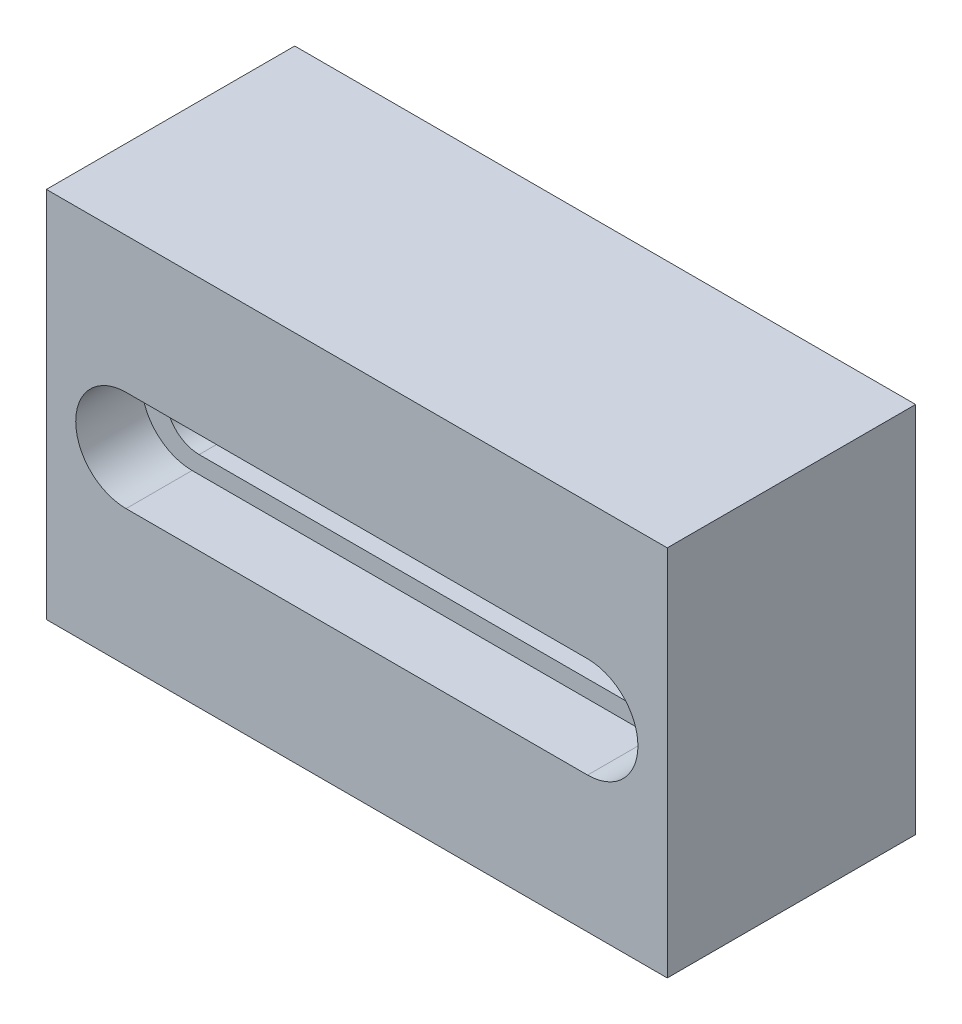
ISO-10303-21;
HEADER;
FILE_DESCRIPTION(('STEP AP214'),'2;1');
FILE_NAME('part.step','',(''),(''),'','','');
FILE_SCHEMA(('AUTOMOTIVE_DESIGN { 1 0 10303 214 1 1 1 1 }'));
ENDSEC;
DATA;
#1=APPLICATION_CONTEXT('core data for automotive mechanical design processes');
#2=APPLICATION_PROTOCOL_DEFINITION('international standard','automotive_design',2000,#1);
#3=PRODUCT_CONTEXT('',#1,'mechanical');
#4=PRODUCT('Part','Part','',(#3));
#5=PRODUCT_RELATED_PRODUCT_CATEGORY('part','',(#4));
#6=PRODUCT_DEFINITION_FORMATION('','',#4);
#7=PRODUCT_DEFINITION_CONTEXT('part definition',#1,'design');
#8=PRODUCT_DEFINITION('design','',#6,#7);
#9=PRODUCT_DEFINITION_SHAPE('','',#8);
#10=(LENGTH_UNIT() NAMED_UNIT(*) SI_UNIT(.MILLI.,.METRE.));
#11=(NAMED_UNIT(*) PLANE_ANGLE_UNIT() SI_UNIT($,.RADIAN.));
#12=(NAMED_UNIT(*) SI_UNIT($,.STERADIAN.) SOLID_ANGLE_UNIT());
#13=UNCERTAINTY_MEASURE_WITH_UNIT(LENGTH_MEASURE(1.E-05),#10,'distance_accuracy_value','');
#14=(GEOMETRIC_REPRESENTATION_CONTEXT(3) GLOBAL_UNCERTAINTY_ASSIGNED_CONTEXT((#13)) GLOBAL_UNIT_ASSIGNED_CONTEXT((#10,
#11,#12)) REPRESENTATION_CONTEXT('',''));
#15=CARTESIAN_POINT('',(0.,0.,0.));
#16=DIRECTION('',(0.,0.,1.));
#17=DIRECTION('',(1.,0.,0.));
#18=AXIS2_PLACEMENT_3D('',#15,#16,#17);
#19=CARTESIAN_POINT('',(63.5,44.85,-50.8));
#20=DIRECTION('',(0.,-1.,0.));
#21=DIRECTION('',(0.,0.,-1.));
#22=AXIS2_PLACEMENT_3D('',#19,#20,#21);
#23=PLANE('',#22);
#24=DIRECTION('',(0.,0.,1.));
#25=VECTOR('',#24,1.);
#26=CARTESIAN_POINT('',(109.25,44.85,-50.8));
#27=LINE('',#26,#25);
#28=CARTESIAN_POINT('',(109.25,44.85,-50.8));
#29=VERTEX_POINT('',#28);
#30=CARTESIAN_POINT('',(109.25,44.85,-13.5));
#31=VERTEX_POINT('',#30);
#32=EDGE_CURVE('E175',#29,#31,#27,.T.);
#33=ORIENTED_EDGE('',*,*,#32,.T.);
#34=DIRECTION('',(-1.,0.,0.));
#35=VECTOR('',#34,1.);
#36=CARTESIAN_POINT('',(63.5,44.85,-13.5));
#37=LINE('',#36,#35);
#38=CARTESIAN_POINT('',(17.75,44.85,-13.5));
#39=VERTEX_POINT('',#38);
#40=EDGE_CURVE('E160',#31,#39,#37,.T.);
#41=ORIENTED_EDGE('',*,*,#40,.T.);
#42=DIRECTION('',(0.,0.,1.));
#43=VECTOR('',#42,1.);
#44=CARTESIAN_POINT('',(17.75,44.85,-50.8));
#45=LINE('',#44,#43);
#46=CARTESIAN_POINT('',(17.75,44.85,-50.8));
#47=VERTEX_POINT('',#46);
#48=EDGE_CURVE('E174',#47,#39,#45,.T.);
#49=ORIENTED_EDGE('',*,*,#48,.F.);
#50=DIRECTION('',(1.,0.,0.));
#51=VECTOR('',#50,1.);
#52=CARTESIAN_POINT('',(63.5,44.85,-50.8));
#53=LINE('',#52,#51);
#54=EDGE_CURVE('E163',#47,#29,#53,.T.);
#55=ORIENTED_EDGE('',*,*,#54,.T.);
#56=EDGE_LOOP('',(#33,#41,#49,#55));
#57=FACE_BOUND('',#56,.T.);
#58=ADVANCED_FACE('F31',(#57),#23,.T.);
#59=CARTESIAN_POINT('',(109.25,38.1,-50.8));
#60=DIRECTION('',(0.,0.,1.));
#61=DIRECTION('',(1.,0.,0.));
#62=AXIS2_PLACEMENT_3D('',#59,#60,#61);
#63=CYLINDRICAL_SURFACE('',#62,6.75);
#64=CARTESIAN_POINT('',(109.25,38.1,-13.5));
#65=DIRECTION('',(0.,0.,1.));
#66=DIRECTION('',(1.,0.,0.));
#67=AXIS2_PLACEMENT_3D('',#64,#65,#66);
#68=CIRCLE('',#67,6.75);
#69=CARTESIAN_POINT('',(109.25,31.35,-13.5));
#70=VERTEX_POINT('',#69);
#71=EDGE_CURVE('E158',#31,#70,#68,.F.);
#72=ORIENTED_EDGE('',*,*,#71,.F.);
#73=ORIENTED_EDGE('',*,*,#32,.F.);
#74=CARTESIAN_POINT('',(109.25,38.1,-50.8));
#75=DIRECTION('',(0.,0.,1.));
#76=DIRECTION('',(1.,0.,0.));
#77=AXIS2_PLACEMENT_3D('',#74,#75,#76);
#78=CIRCLE('',#77,6.75);
#79=CARTESIAN_POINT('',(109.25,31.35,-50.8));
#80=VERTEX_POINT('',#79);
#81=EDGE_CURVE('E171',#80,#29,#78,.T.);
#82=ORIENTED_EDGE('',*,*,#81,.F.);
#83=DIRECTION('',(0.,0.,1.));
#84=VECTOR('',#83,1.);
#85=CARTESIAN_POINT('',(109.25,31.35,-50.8));
#86=LINE('',#85,#84);
#87=EDGE_CURVE('E179',#80,#70,#86,.T.);
#88=ORIENTED_EDGE('',*,*,#87,.T.);
#89=EDGE_LOOP('',(#72,#73,#82,#88));
#90=FACE_BOUND('',#89,.T.);
#91=ADVANCED_FACE('F245',(#90),#63,.F.);
#92=CARTESIAN_POINT('',(63.5,31.35,-50.8));
#93=DIRECTION('',(0.,-1.,0.));
#94=DIRECTION('',(0.,0.,-1.));
#95=AXIS2_PLACEMENT_3D('',#92,#93,#94);
#96=PLANE('',#95);
#97=DIRECTION('',(-1.,0.,0.));
#98=VECTOR('',#97,1.);
#99=CARTESIAN_POINT('',(63.5,31.35,-13.5));
#100=LINE('',#99,#98);
#101=CARTESIAN_POINT('',(17.75,31.35,-13.5));
#102=VERTEX_POINT('',#101);
#103=EDGE_CURVE('E53',#70,#102,#100,.T.);
#104=ORIENTED_EDGE('',*,*,#103,.F.);
#105=ORIENTED_EDGE('',*,*,#87,.F.);
#106=DIRECTION('',(1.,0.,0.));
#107=VECTOR('',#106,1.);
#108=CARTESIAN_POINT('',(63.5,31.35,-50.8));
#109=LINE('',#108,#107);
#110=CARTESIAN_POINT('',(17.75,31.35,-50.8));
#111=VERTEX_POINT('',#110);
#112=EDGE_CURVE('E168',#111,#80,#109,.T.);
#113=ORIENTED_EDGE('',*,*,#112,.F.);
#114=DIRECTION('',(0.,0.,1.));
#115=VECTOR('',#114,1.);
#116=CARTESIAN_POINT('',(17.75,31.35,-50.8));
#117=LINE('',#116,#115);
#118=EDGE_CURVE('E182',#111,#102,#117,.T.);
#119=ORIENTED_EDGE('',*,*,#118,.T.);
#120=EDGE_LOOP('',(#104,#105,#113,#119));
#121=FACE_BOUND('',#120,.T.);
#122=ADVANCED_FACE('F250',(#121),#96,.F.);
#123=CARTESIAN_POINT('',(17.75,38.1,-50.8));
#124=DIRECTION('',(0.,0.,1.));
#125=DIRECTION('',(1.,0.,0.));
#126=AXIS2_PLACEMENT_3D('',#123,#124,#125);
#127=CYLINDRICAL_SURFACE('',#126,6.75);
#128=CARTESIAN_POINT('',(17.75,38.1,-13.5));
#129=DIRECTION('',(0.,0.,1.));
#130=DIRECTION('',(1.,0.,0.));
#131=AXIS2_PLACEMENT_3D('',#128,#129,#130);
#132=CIRCLE('',#131,6.75);
#133=EDGE_CURVE('E11',#102,#39,#132,.F.);
#134=ORIENTED_EDGE('',*,*,#133,.F.);
#135=ORIENTED_EDGE('',*,*,#118,.F.);
#136=CARTESIAN_POINT('',(17.75,38.1,-50.8));
#137=DIRECTION('',(0.,0.,1.));
#138=DIRECTION('',(1.,0.,0.));
#139=AXIS2_PLACEMENT_3D('',#136,#137,#138);
#140=CIRCLE('',#139,6.75);
#141=EDGE_CURVE('E165',#47,#111,#140,.T.);
#142=ORIENTED_EDGE('',*,*,#141,.F.);
#143=ORIENTED_EDGE('',*,*,#48,.T.);
#144=EDGE_LOOP('',(#134,#135,#142,#143));
#145=FACE_BOUND('',#144,.T.);
#146=ADVANCED_FACE('F254',(#145),#127,.F.);
#147=CARTESIAN_POINT('',(0.,76.2,0.));
#148=DIRECTION('',(0.,0.,-1.));
#149=DIRECTION('',(-1.,0.,0.));
#150=AXIS2_PLACEMENT_3D('',#147,#148,#149);
#151=PLANE('',#150);
#152=CARTESIAN_POINT('',(110.7,38.1,0.));
#153=DIRECTION('',(0.,0.,1.));
#154=DIRECTION('',(1.,0.,0.));
#155=AXIS2_PLACEMENT_3D('',#152,#153,#154);
#156=CIRCLE('',#155,10.3);
#157=CARTESIAN_POINT('',(110.7,27.8,0.));
#158=VERTEX_POINT('',#157);
#159=CARTESIAN_POINT('',(110.7,48.4,0.));
#160=VERTEX_POINT('',#159);
#161=EDGE_CURVE('E148',#158,#160,#156,.T.);
#162=ORIENTED_EDGE('',*,*,#161,.F.);
#163=DIRECTION('',(1.,0.,0.));
#164=VECTOR('',#163,1.);
#165=CARTESIAN_POINT('',(63.5,27.8,0.));
#166=LINE('',#165,#164);
#167=CARTESIAN_POINT('',(16.3,27.8,0.));
#168=VERTEX_POINT('',#167);
#169=EDGE_CURVE('E46',#168,#158,#166,.T.);
#170=ORIENTED_EDGE('',*,*,#169,.F.);
#171=CARTESIAN_POINT('',(16.3,38.1,0.));
#172=DIRECTION('',(0.,0.,1.));
#173=DIRECTION('',(1.,0.,0.));
#174=AXIS2_PLACEMENT_3D('',#171,#172,#173);
#175=CIRCLE('',#174,10.3);
#176=CARTESIAN_POINT('',(16.3,48.4,0.));
#177=VERTEX_POINT('',#176);
#178=EDGE_CURVE('E139',#177,#168,#175,.T.);
#179=ORIENTED_EDGE('',*,*,#178,.F.);
#180=DIRECTION('',(1.,0.,0.));
#181=VECTOR('',#180,1.);
#182=CARTESIAN_POINT('',(63.5,48.4,0.));
#183=LINE('',#182,#181);
#184=EDGE_CURVE('E142',#177,#160,#183,.T.);
#185=ORIENTED_EDGE('',*,*,#184,.T.);
#186=EDGE_LOOP('',(#162,#170,#179,#185));
#187=FACE_BOUND('',#186,.T.);
#188=DIRECTION('',(1.,0.,0.));
#189=VECTOR('',#188,1.);
#190=CARTESIAN_POINT('',(0.,0.,0.));
#191=LINE('',#190,#189);
#192=CARTESIAN_POINT('',(0.,0.,0.));
#193=VERTEX_POINT('',#192);
#194=CARTESIAN_POINT('',(127.,0.,0.));
#195=VERTEX_POINT('',#194);
#196=EDGE_CURVE('E200',#193,#195,#191,.T.);
#197=ORIENTED_EDGE('',*,*,#196,.T.);
#198=DIRECTION('',(0.,-1.,0.));
#199=VECTOR('',#198,1.);
#200=CARTESIAN_POINT('',(127.,76.2,0.));
#201=LINE('',#200,#199);
#202=CARTESIAN_POINT('',(127.,76.2,0.));
#203=VERTEX_POINT('',#202);
#204=EDGE_CURVE('E210',#203,#195,#201,.T.);
#205=ORIENTED_EDGE('',*,*,#204,.F.);
#206=DIRECTION('',(1.,0.,0.));
#207=VECTOR('',#206,1.);
#208=CARTESIAN_POINT('',(0.,76.2,0.));
#209=LINE('',#208,#207);
#210=CARTESIAN_POINT('',(0.,76.2,0.));
#211=VERTEX_POINT('',#210);
#212=EDGE_CURVE('E190',#211,#203,#209,.T.);
#213=ORIENTED_EDGE('',*,*,#212,.F.);
#214=DIRECTION('',(0.,-1.,0.));
#215=VECTOR('',#214,1.);
#216=CARTESIAN_POINT('',(0.,76.2,0.));
#217=LINE('',#216,#215);
#218=EDGE_CURVE('E39',#211,#193,#217,.T.);
#219=ORIENTED_EDGE('',*,*,#218,.T.);
#220=EDGE_LOOP('',(#197,#205,#213,#219));
#221=FACE_BOUND('',#220,.T.);
#222=ADVANCED_FACE('F215',(#187,#221),#151,.F.);
#223=CARTESIAN_POINT('',(0.,76.2,-50.8));
#224=DIRECTION('',(0.,0.,1.));
#225=DIRECTION('',(1.,0.,0.));
#226=AXIS2_PLACEMENT_3D('',#223,#224,#225);
#227=PLANE('',#226);
#228=DIRECTION('',(-1.,0.,0.));
#229=VECTOR('',#228,1.);
#230=CARTESIAN_POINT('',(0.,0.,-50.8));
#231=LINE('',#230,#229);
#232=CARTESIAN_POINT('',(127.,0.,-50.8));
#233=VERTEX_POINT('',#232);
#234=CARTESIAN_POINT('',(0.,0.,-50.8));
#235=VERTEX_POINT('',#234);
#236=EDGE_CURVE('E191',#233,#235,#231,.T.);
#237=ORIENTED_EDGE('',*,*,#236,.T.);
#238=DIRECTION('',(0.,-1.,0.));
#239=VECTOR('',#238,1.);
#240=CARTESIAN_POINT('',(0.,76.2,-50.8));
#241=LINE('',#240,#239);
#242=CARTESIAN_POINT('',(0.,76.2,-50.8));
#243=VERTEX_POINT('',#242);
#244=EDGE_CURVE('E197',#243,#235,#241,.T.);
#245=ORIENTED_EDGE('',*,*,#244,.F.);
#246=DIRECTION('',(-1.,0.,0.));
#247=VECTOR('',#246,1.);
#248=CARTESIAN_POINT('',(0.,76.2,-50.8));
#249=LINE('',#248,#247);
#250=CARTESIAN_POINT('',(127.,76.2,-50.8));
#251=VERTEX_POINT('',#250);
#252=EDGE_CURVE('E195',#251,#243,#249,.T.);
#253=ORIENTED_EDGE('',*,*,#252,.F.);
#254=DIRECTION('',(0.,-1.,0.));
#255=VECTOR('',#254,1.);
#256=CARTESIAN_POINT('',(127.,76.2,-50.8));
#257=LINE('',#256,#255);
#258=EDGE_CURVE('E207',#251,#233,#257,.T.);
#259=ORIENTED_EDGE('',*,*,#258,.T.);
#260=EDGE_LOOP('',(#237,#245,#253,#259));
#261=FACE_BOUND('',#260,.T.);
#262=ORIENTED_EDGE('',*,*,#54,.F.);
#263=ORIENTED_EDGE('',*,*,#141,.T.);
#264=ORIENTED_EDGE('',*,*,#112,.T.);
#265=ORIENTED_EDGE('',*,*,#81,.T.);
#266=EDGE_LOOP('',(#262,#263,#264,#265));
#267=FACE_BOUND('',#266,.T.);
#268=ADVANCED_FACE('F231',(#261,#267),#227,.F.);
#269=CARTESIAN_POINT('',(0.,76.2,0.));
#270=DIRECTION('',(1.,0.,0.));
#271=DIRECTION('',(0.,0.,-1.));
#272=AXIS2_PLACEMENT_3D('',#269,#270,#271);
#273=PLANE('',#272);
#274=DIRECTION('',(0.,0.,1.));
#275=VECTOR('',#274,1.);
#276=CARTESIAN_POINT('',(0.,0.,0.));
#277=LINE('',#276,#275);
#278=EDGE_CURVE('E178',#235,#193,#277,.T.);
#279=ORIENTED_EDGE('',*,*,#278,.T.);
#280=ORIENTED_EDGE('',*,*,#218,.F.);
#281=DIRECTION('',(0.,0.,1.));
#282=VECTOR('',#281,1.);
#283=CARTESIAN_POINT('',(0.,76.2,0.));
#284=LINE('',#283,#282);
#285=EDGE_CURVE('E187',#243,#211,#284,.T.);
#286=ORIENTED_EDGE('',*,*,#285,.F.);
#287=ORIENTED_EDGE('',*,*,#244,.T.);
#288=EDGE_LOOP('',(#279,#280,#286,#287));
#289=FACE_BOUND('',#288,.T.);
#290=ADVANCED_FACE('F33',(#289),#273,.F.);
#291=CARTESIAN_POINT('',(127.,76.2,0.));
#292=DIRECTION('',(-1.,0.,0.));
#293=DIRECTION('',(0.,0.,1.));
#294=AXIS2_PLACEMENT_3D('',#291,#292,#293);
#295=PLANE('',#294);
#296=DIRECTION('',(0.,0.,-1.));
#297=VECTOR('',#296,1.);
#298=CARTESIAN_POINT('',(127.,0.,0.));
#299=LINE('',#298,#297);
#300=EDGE_CURVE('E202',#195,#233,#299,.T.);
#301=ORIENTED_EDGE('',*,*,#300,.T.);
#302=ORIENTED_EDGE('',*,*,#258,.F.);
#303=DIRECTION('',(0.,0.,-1.));
#304=VECTOR('',#303,1.);
#305=CARTESIAN_POINT('',(127.,76.2,0.));
#306=LINE('',#305,#304);
#307=EDGE_CURVE('E193',#203,#251,#306,.T.);
#308=ORIENTED_EDGE('',*,*,#307,.F.);
#309=ORIENTED_EDGE('',*,*,#204,.T.);
#310=EDGE_LOOP('',(#301,#302,#308,#309));
#311=FACE_BOUND('',#310,.T.);
#312=ADVANCED_FACE('F227',(#311),#295,.F.);
#313=CARTESIAN_POINT('',(0.,76.2,-50.8));
#314=DIRECTION('',(0.,-1.,0.));
#315=DIRECTION('',(0.,0.,-1.));
#316=AXIS2_PLACEMENT_3D('',#313,#314,#315);
#317=PLANE('',#316);
#318=ORIENTED_EDGE('',*,*,#285,.T.);
#319=ORIENTED_EDGE('',*,*,#212,.T.);
#320=ORIENTED_EDGE('',*,*,#307,.T.);
#321=ORIENTED_EDGE('',*,*,#252,.T.);
#322=EDGE_LOOP('',(#318,#319,#320,#321));
#323=FACE_BOUND('',#322,.T.);
#324=ADVANCED_FACE('F234',(#323),#317,.F.);
#325=CARTESIAN_POINT('',(0.,0.,-50.8));
#326=DIRECTION('',(0.,-1.,0.));
#327=DIRECTION('',(0.,0.,-1.));
#328=AXIS2_PLACEMENT_3D('',#325,#326,#327);
#329=PLANE('',#328);
#330=ORIENTED_EDGE('',*,*,#278,.F.);
#331=ORIENTED_EDGE('',*,*,#236,.F.);
#332=ORIENTED_EDGE('',*,*,#300,.F.);
#333=ORIENTED_EDGE('',*,*,#196,.F.);
#334=EDGE_LOOP('',(#330,#331,#332,#333));
#335=FACE_BOUND('',#334,.T.);
#336=ADVANCED_FACE('F223',(#335),#329,.T.);
#337=CARTESIAN_POINT('',(63.5,27.8,-13.5));
#338=DIRECTION('',(0.,-1.,0.));
#339=DIRECTION('',(0.,0.,-1.));
#340=AXIS2_PLACEMENT_3D('',#337,#338,#339);
#341=PLANE('',#340);
#342=ORIENTED_EDGE('',*,*,#169,.T.);
#343=DIRECTION('',(0.,0.,1.));
#344=VECTOR('',#343,1.);
#345=CARTESIAN_POINT('',(110.7,27.8,-13.5));
#346=LINE('',#345,#344);
#347=CARTESIAN_POINT('',(110.7,27.8,-13.5));
#348=VERTEX_POINT('',#347);
#349=EDGE_CURVE('E117',#348,#158,#346,.T.);
#350=ORIENTED_EDGE('',*,*,#349,.F.);
#351=DIRECTION('',(1.,0.,0.));
#352=VECTOR('',#351,1.);
#353=CARTESIAN_POINT('',(63.5,27.8,-13.5));
#354=LINE('',#353,#352);
#355=CARTESIAN_POINT('',(16.3,27.8,-13.5));
#356=VERTEX_POINT('',#355);
#357=EDGE_CURVE('E121',#356,#348,#354,.T.);
#358=ORIENTED_EDGE('',*,*,#357,.F.);
#359=DIRECTION('',(0.,0.,1.));
#360=VECTOR('',#359,1.);
#361=CARTESIAN_POINT('',(16.3,27.8,-13.5));
#362=LINE('',#361,#360);
#363=EDGE_CURVE('E152',#356,#168,#362,.T.);
#364=ORIENTED_EDGE('',*,*,#363,.T.);
#365=EDGE_LOOP('',(#342,#350,#358,#364));
#366=FACE_BOUND('',#365,.T.);
#367=ADVANCED_FACE('F119',(#366),#341,.F.);
#368=CARTESIAN_POINT('',(16.3,38.1,-13.5));
#369=DIRECTION('',(0.,0.,1.));
#370=DIRECTION('',(1.,0.,0.));
#371=AXIS2_PLACEMENT_3D('',#368,#369,#370);
#372=CYLINDRICAL_SURFACE('',#371,10.3);
#373=ORIENTED_EDGE('',*,*,#178,.T.);
#374=ORIENTED_EDGE('',*,*,#363,.F.);
#375=CARTESIAN_POINT('',(16.3,38.1,-13.5));
#376=DIRECTION('',(0.,0.,1.));
#377=DIRECTION('',(1.,0.,0.));
#378=AXIS2_PLACEMENT_3D('',#375,#376,#377);
#379=CIRCLE('',#378,10.3);
#380=CARTESIAN_POINT('',(16.3,48.4,-13.5));
#381=VERTEX_POINT('',#380);
#382=EDGE_CURVE('E127',#381,#356,#379,.T.);
#383=ORIENTED_EDGE('',*,*,#382,.F.);
#384=DIRECTION('',(0.,0.,1.));
#385=VECTOR('',#384,1.);
#386=CARTESIAN_POINT('',(16.3,48.4,-13.5));
#387=LINE('',#386,#385);
#388=EDGE_CURVE('E154',#381,#177,#387,.T.);
#389=ORIENTED_EDGE('',*,*,#388,.T.);
#390=EDGE_LOOP('',(#373,#374,#383,#389));
#391=FACE_BOUND('',#390,.T.);
#392=ADVANCED_FACE('F263',(#391),#372,.F.);
#393=CARTESIAN_POINT('',(63.5,48.4,-13.5));
#394=DIRECTION('',(0.,-1.,0.));
#395=DIRECTION('',(0.,0.,-1.));
#396=AXIS2_PLACEMENT_3D('',#393,#394,#395);
#397=PLANE('',#396);
#398=ORIENTED_EDGE('',*,*,#184,.F.);
#399=ORIENTED_EDGE('',*,*,#388,.F.);
#400=DIRECTION('',(1.,0.,0.));
#401=VECTOR('',#400,1.);
#402=CARTESIAN_POINT('',(63.5,48.4,-13.5));
#403=LINE('',#402,#401);
#404=CARTESIAN_POINT('',(110.7,48.4,-13.5));
#405=VERTEX_POINT('',#404);
#406=EDGE_CURVE('E135',#381,#405,#403,.T.);
#407=ORIENTED_EDGE('',*,*,#406,.T.);
#408=DIRECTION('',(0.,0.,1.));
#409=VECTOR('',#408,1.);
#410=CARTESIAN_POINT('',(110.7,48.4,-13.5));
#411=LINE('',#410,#409);
#412=EDGE_CURVE('E126',#405,#160,#411,.T.);
#413=ORIENTED_EDGE('',*,*,#412,.T.);
#414=EDGE_LOOP('',(#398,#399,#407,#413));
#415=FACE_BOUND('',#414,.T.);
#416=ADVANCED_FACE('F266',(#415),#397,.T.);
#417=CARTESIAN_POINT('',(110.7,38.1,-13.5));
#418=DIRECTION('',(0.,0.,1.));
#419=DIRECTION('',(1.,0.,0.));
#420=AXIS2_PLACEMENT_3D('',#417,#418,#419);
#421=CYLINDRICAL_SURFACE('',#420,10.3);
#422=ORIENTED_EDGE('',*,*,#161,.T.);
#423=ORIENTED_EDGE('',*,*,#412,.F.);
#424=CARTESIAN_POINT('',(110.7,38.1,-13.5));
#425=DIRECTION('',(0.,0.,1.));
#426=DIRECTION('',(1.,0.,0.));
#427=AXIS2_PLACEMENT_3D('',#424,#425,#426);
#428=CIRCLE('',#427,10.3);
#429=EDGE_CURVE('E131',#348,#405,#428,.T.);
#430=ORIENTED_EDGE('',*,*,#429,.F.);
#431=ORIENTED_EDGE('',*,*,#349,.T.);
#432=EDGE_LOOP('',(#422,#423,#430,#431));
#433=FACE_BOUND('',#432,.T.);
#434=ADVANCED_FACE('F132',(#433),#421,.F.);
#435=CARTESIAN_POINT('',(63.5,-77.2409925359947,-13.5));
#436=DIRECTION('',(0.,0.,1.));
#437=DIRECTION('',(1.,0.,0.));
#438=AXIS2_PLACEMENT_3D('',#435,#436,#437);
#439=PLANE('',#438);
#440=ORIENTED_EDGE('',*,*,#71,.T.);
#441=ORIENTED_EDGE('',*,*,#103,.T.);
#442=ORIENTED_EDGE('',*,*,#133,.T.);
#443=ORIENTED_EDGE('',*,*,#40,.F.);
#444=EDGE_LOOP('',(#440,#441,#442,#443));
#445=FACE_BOUND('',#444,.T.);
#446=ORIENTED_EDGE('',*,*,#357,.T.);
#447=ORIENTED_EDGE('',*,*,#429,.T.);
#448=ORIENTED_EDGE('',*,*,#406,.F.);
#449=ORIENTED_EDGE('',*,*,#382,.T.);
#450=EDGE_LOOP('',(#446,#447,#448,#449));
#451=FACE_BOUND('',#450,.T.);
#452=ADVANCED_FACE('F137',(#445,#451),#439,.T.);
#453=CLOSED_SHELL('',(#58,#91,#122,#146,#222,#268,#290,#312,#324,#336,#367,#392,#416,#434,#452));
#454=MANIFOLD_SOLID_BREP('B2',#453);
#455=ADVANCED_BREP_SHAPE_REPRESENTATION('',(#18,#454),#14);
#456=SHAPE_DEFINITION_REPRESENTATION(#9,#455);
ENDSEC;
END-ISO-10303-21;
